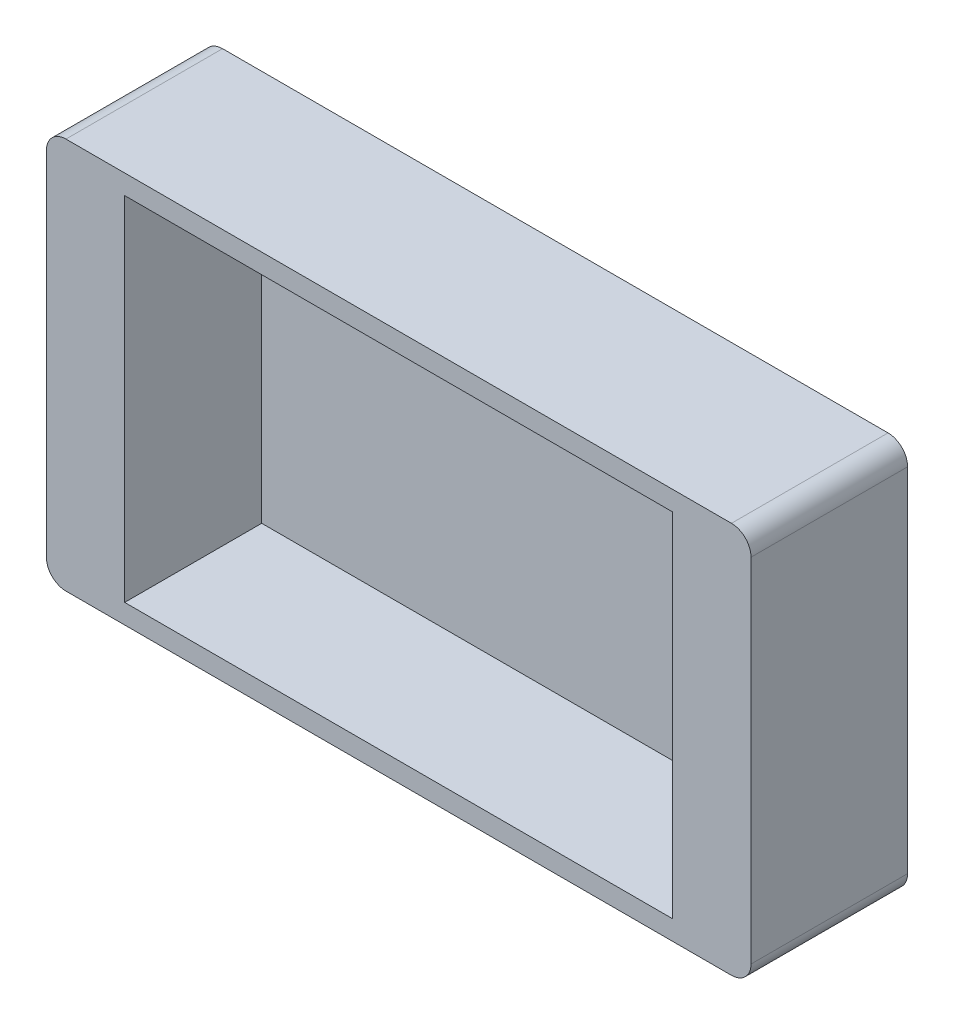
ISO-10303-21;
HEADER;
FILE_DESCRIPTION(('STEP AP214'),'2;1');
FILE_NAME('part.step','',(''),(''),'','','');
FILE_SCHEMA(('AUTOMOTIVE_DESIGN { 1 0 10303 214 1 1 1 1 }'));
ENDSEC;
DATA;
#1=APPLICATION_CONTEXT('core data for automotive mechanical design processes');
#2=APPLICATION_PROTOCOL_DEFINITION('international standard','automotive_design',2000,#1);
#3=PRODUCT_CONTEXT('',#1,'mechanical');
#4=PRODUCT('Part','Part','',(#3));
#5=PRODUCT_RELATED_PRODUCT_CATEGORY('part','',(#4));
#6=PRODUCT_DEFINITION_FORMATION('','',#4);
#7=PRODUCT_DEFINITION_CONTEXT('part definition',#1,'design');
#8=PRODUCT_DEFINITION('design','',#6,#7);
#9=PRODUCT_DEFINITION_SHAPE('','',#8);
#10=(LENGTH_UNIT() NAMED_UNIT(*) SI_UNIT(.MILLI.,.METRE.));
#11=(NAMED_UNIT(*) PLANE_ANGLE_UNIT() SI_UNIT($,.RADIAN.));
#12=(NAMED_UNIT(*) SI_UNIT($,.STERADIAN.) SOLID_ANGLE_UNIT());
#13=UNCERTAINTY_MEASURE_WITH_UNIT(LENGTH_MEASURE(1.E-05),#10,'distance_accuracy_value','');
#14=(GEOMETRIC_REPRESENTATION_CONTEXT(3) GLOBAL_UNCERTAINTY_ASSIGNED_CONTEXT((#13)) GLOBAL_UNIT_ASSIGNED_CONTEXT((#10,
#11,#12)) REPRESENTATION_CONTEXT('',''));
#15=CARTESIAN_POINT('',(0.,0.,0.));
#16=DIRECTION('',(0.,0.,1.));
#17=DIRECTION('',(1.,0.,0.));
#18=AXIS2_PLACEMENT_3D('',#15,#16,#17);
#19=CARTESIAN_POINT('',(43.18,22.86,20.32));
#20=DIRECTION('',(0.,0.,-1.));
#21=DIRECTION('',(-1.,0.,0.));
#22=AXIS2_PLACEMENT_3D('',#19,#20,#21);
#23=PLANE('',#22);
#24=DIRECTION('',(-1.,0.,0.));
#25=VECTOR('',#24,1.);
#26=CARTESIAN_POINT('',(43.18,22.86,20.32));
#27=LINE('',#26,#25);
#28=CARTESIAN_POINT('',(35.56,22.86,20.32));
#29=VERTEX_POINT('',#28);
#30=CARTESIAN_POINT('',(-35.56,22.86,20.32));
#31=VERTEX_POINT('',#30);
#32=EDGE_CURVE('E134',#29,#31,#27,.T.);
#33=ORIENTED_EDGE('',*,*,#32,.F.);
#34=DIRECTION('',(0.,-1.,0.));
#35=VECTOR('',#34,1.);
#36=CARTESIAN_POINT('',(35.56,22.86,20.32));
#37=LINE('',#36,#35);
#38=CARTESIAN_POINT('',(35.56,-22.86,20.32));
#39=VERTEX_POINT('',#38);
#40=EDGE_CURVE('E121',#29,#39,#37,.T.);
#41=ORIENTED_EDGE('',*,*,#40,.T.);
#42=DIRECTION('',(1.,0.,0.));
#43=VECTOR('',#42,1.);
#44=CARTESIAN_POINT('',(43.18,-22.86,20.32));
#45=LINE('',#44,#43);
#46=CARTESIAN_POINT('',(-35.56,-22.86,20.32));
#47=VERTEX_POINT('',#46);
#48=EDGE_CURVE('E142',#47,#39,#45,.T.);
#49=ORIENTED_EDGE('',*,*,#48,.F.);
#50=DIRECTION('',(0.,-1.,0.));
#51=VECTOR('',#50,1.);
#52=CARTESIAN_POINT('',(-35.56,22.86,20.32));
#53=LINE('',#52,#51);
#54=EDGE_CURVE('E141',#31,#47,#53,.T.);
#55=ORIENTED_EDGE('',*,*,#54,.F.);
#56=EDGE_LOOP('',(#33,#41,#49,#55));
#57=FACE_BOUND('',#56,.T.);
#58=CARTESIAN_POINT('',(43.18,22.86,20.32));
#59=DIRECTION('',(0.,0.,1.));
#60=DIRECTION('',(-1.,0.,0.));
#61=AXIS2_PLACEMENT_3D('',#58,#59,#60);
#62=CIRCLE('',#61,2.54);
#63=CARTESIAN_POINT('',(45.72,22.86,20.32));
#64=VERTEX_POINT('',#63);
#65=CARTESIAN_POINT('',(43.18,25.4,20.32));
#66=VERTEX_POINT('',#65);
#67=EDGE_CURVE('E151',#64,#66,#62,.T.);
#68=ORIENTED_EDGE('',*,*,#67,.T.);
#69=DIRECTION('',(-1.,0.,0.));
#70=VECTOR('',#69,1.);
#71=CARTESIAN_POINT('',(-43.18,25.4,20.32));
#72=LINE('',#71,#70);
#73=CARTESIAN_POINT('',(-43.18,25.4,20.32));
#74=VERTEX_POINT('',#73);
#75=EDGE_CURVE('E154',#66,#74,#72,.T.);
#76=ORIENTED_EDGE('',*,*,#75,.T.);
#77=CARTESIAN_POINT('',(-43.18,22.86,20.32));
#78=DIRECTION('',(0.,0.,1.));
#79=DIRECTION('',(1.,0.,0.));
#80=AXIS2_PLACEMENT_3D('',#77,#78,#79);
#81=CIRCLE('',#80,2.54);
#82=CARTESIAN_POINT('',(-45.72,22.86,20.32));
#83=VERTEX_POINT('',#82);
#84=EDGE_CURVE('E157',#74,#83,#81,.T.);
#85=ORIENTED_EDGE('',*,*,#84,.T.);
#86=DIRECTION('',(0.,-1.,0.));
#87=VECTOR('',#86,1.);
#88=CARTESIAN_POINT('',(-45.72,22.86,20.32));
#89=LINE('',#88,#87);
#90=CARTESIAN_POINT('',(-45.72,-22.86,20.32));
#91=VERTEX_POINT('',#90);
#92=EDGE_CURVE('E159',#83,#91,#89,.T.);
#93=ORIENTED_EDGE('',*,*,#92,.T.);
#94=CARTESIAN_POINT('',(-43.18,-22.86,20.32));
#95=DIRECTION('',(0.,0.,1.));
#96=DIRECTION('',(1.,0.,0.));
#97=AXIS2_PLACEMENT_3D('',#94,#95,#96);
#98=CIRCLE('',#97,2.54);
#99=CARTESIAN_POINT('',(-43.18,-25.4,20.32));
#100=VERTEX_POINT('',#99);
#101=EDGE_CURVE('E161',#91,#100,#98,.T.);
#102=ORIENTED_EDGE('',*,*,#101,.T.);
#103=DIRECTION('',(1.,0.,0.));
#104=VECTOR('',#103,1.);
#105=CARTESIAN_POINT('',(-43.18,-25.4,20.32));
#106=LINE('',#105,#104);
#107=CARTESIAN_POINT('',(43.18,-25.4,20.32));
#108=VERTEX_POINT('',#107);
#109=EDGE_CURVE('E163',#100,#108,#106,.T.);
#110=ORIENTED_EDGE('',*,*,#109,.T.);
#111=CARTESIAN_POINT('',(43.18,-22.86,20.32));
#112=DIRECTION('',(0.,0.,1.));
#113=DIRECTION('',(1.,0.,0.));
#114=AXIS2_PLACEMENT_3D('',#111,#112,#113);
#115=CIRCLE('',#114,2.54);
#116=CARTESIAN_POINT('',(45.72,-22.86,20.32));
#117=VERTEX_POINT('',#116);
#118=EDGE_CURVE('E165',#108,#117,#115,.T.);
#119=ORIENTED_EDGE('',*,*,#118,.T.);
#120=DIRECTION('',(0.,1.,0.));
#121=VECTOR('',#120,1.);
#122=CARTESIAN_POINT('',(45.72,22.86,20.32));
#123=LINE('',#122,#121);
#124=EDGE_CURVE('E167',#117,#64,#123,.T.);
#125=ORIENTED_EDGE('',*,*,#124,.T.);
#126=EDGE_LOOP('',(#68,#76,#85,#93,#102,#110,#119,#125));
#127=FACE_BOUND('',#126,.T.);
#128=ADVANCED_FACE('F33',(#57,#127),#23,.F.);
#129=CARTESIAN_POINT('',(43.18,22.86,20.32));
#130=DIRECTION('',(0.,0.,-1.));
#131=DIRECTION('',(-1.,0.,0.));
#132=AXIS2_PLACEMENT_3D('',#129,#130,#131);
#133=CYLINDRICAL_SURFACE('',#132,2.54);
#134=CARTESIAN_POINT('',(43.18,22.86,0.));
#135=DIRECTION('',(0.,0.,1.));
#136=DIRECTION('',(-1.,0.,0.));
#137=AXIS2_PLACEMENT_3D('',#134,#135,#136);
#138=CIRCLE('',#137,2.54);
#139=CARTESIAN_POINT('',(45.72,22.86,0.));
#140=VERTEX_POINT('',#139);
#141=CARTESIAN_POINT('',(43.18,25.4,0.));
#142=VERTEX_POINT('',#141);
#143=EDGE_CURVE('E145',#140,#142,#138,.T.);
#144=ORIENTED_EDGE('',*,*,#143,.T.);
#145=DIRECTION('',(0.,0.,-1.));
#146=VECTOR('',#145,1.);
#147=CARTESIAN_POINT('',(43.18,25.4,20.32));
#148=LINE('',#147,#146);
#149=EDGE_CURVE('E11',#66,#142,#148,.T.);
#150=ORIENTED_EDGE('',*,*,#149,.F.);
#151=ORIENTED_EDGE('',*,*,#67,.F.);
#152=DIRECTION('',(0.,0.,-1.));
#153=VECTOR('',#152,1.);
#154=CARTESIAN_POINT('',(45.72,22.86,20.32));
#155=LINE('',#154,#153);
#156=EDGE_CURVE('E169',#64,#140,#155,.T.);
#157=ORIENTED_EDGE('',*,*,#156,.T.);
#158=EDGE_LOOP('',(#144,#150,#151,#157));
#159=FACE_BOUND('',#158,.T.);
#160=ADVANCED_FACE('F35',(#159),#133,.T.);
#161=CARTESIAN_POINT('',(-43.18,25.4,20.32));
#162=DIRECTION('',(0.,-1.,0.));
#163=DIRECTION('',(0.,0.,-1.));
#164=AXIS2_PLACEMENT_3D('',#161,#162,#163);
#165=PLANE('',#164);
#166=DIRECTION('',(-1.,0.,0.));
#167=VECTOR('',#166,1.);
#168=CARTESIAN_POINT('',(-43.18,25.4,0.));
#169=LINE('',#168,#167);
#170=CARTESIAN_POINT('',(-43.18,25.4,0.));
#171=VERTEX_POINT('',#170);
#172=EDGE_CURVE('E172',#142,#171,#169,.T.);
#173=ORIENTED_EDGE('',*,*,#172,.T.);
#174=DIRECTION('',(0.,0.,-1.));
#175=VECTOR('',#174,1.);
#176=CARTESIAN_POINT('',(-43.18,25.4,20.32));
#177=LINE('',#176,#175);
#178=EDGE_CURVE('E41',#74,#171,#177,.T.);
#179=ORIENTED_EDGE('',*,*,#178,.F.);
#180=ORIENTED_EDGE('',*,*,#75,.F.);
#181=ORIENTED_EDGE('',*,*,#149,.T.);
#182=EDGE_LOOP('',(#173,#179,#180,#181));
#183=FACE_BOUND('',#182,.T.);
#184=ADVANCED_FACE('F227',(#183),#165,.F.);
#185=CARTESIAN_POINT('',(-43.18,22.86,20.32));
#186=DIRECTION('',(0.,0.,-1.));
#187=DIRECTION('',(-1.,0.,0.));
#188=AXIS2_PLACEMENT_3D('',#185,#186,#187);
#189=CYLINDRICAL_SURFACE('',#188,2.54);
#190=CARTESIAN_POINT('',(-43.18,22.86,0.));
#191=DIRECTION('',(0.,0.,1.));
#192=DIRECTION('',(1.,0.,0.));
#193=AXIS2_PLACEMENT_3D('',#190,#191,#192);
#194=CIRCLE('',#193,2.54);
#195=CARTESIAN_POINT('',(-45.72,22.86,0.));
#196=VERTEX_POINT('',#195);
#197=EDGE_CURVE('E174',#171,#196,#194,.T.);
#198=ORIENTED_EDGE('',*,*,#197,.T.);
#199=DIRECTION('',(0.,0.,-1.));
#200=VECTOR('',#199,1.);
#201=CARTESIAN_POINT('',(-45.72,22.86,20.32));
#202=LINE('',#201,#200);
#203=EDGE_CURVE('E199',#83,#196,#202,.T.);
#204=ORIENTED_EDGE('',*,*,#203,.F.);
#205=ORIENTED_EDGE('',*,*,#84,.F.);
#206=ORIENTED_EDGE('',*,*,#178,.T.);
#207=EDGE_LOOP('',(#198,#204,#205,#206));
#208=FACE_BOUND('',#207,.T.);
#209=ADVANCED_FACE('F206',(#208),#189,.T.);
#210=CARTESIAN_POINT('',(-45.72,22.86,20.32));
#211=DIRECTION('',(1.,0.,0.));
#212=DIRECTION('',(0.,0.,-1.));
#213=AXIS2_PLACEMENT_3D('',#210,#211,#212);
#214=PLANE('',#213);
#215=DIRECTION('',(0.,-1.,0.));
#216=VECTOR('',#215,1.);
#217=CARTESIAN_POINT('',(-45.72,22.86,0.));
#218=LINE('',#217,#216);
#219=CARTESIAN_POINT('',(-45.72,-22.86,0.));
#220=VERTEX_POINT('',#219);
#221=EDGE_CURVE('E176',#196,#220,#218,.T.);
#222=ORIENTED_EDGE('',*,*,#221,.T.);
#223=DIRECTION('',(0.,0.,-1.));
#224=VECTOR('',#223,1.);
#225=CARTESIAN_POINT('',(-45.72,-22.86,20.32));
#226=LINE('',#225,#224);
#227=EDGE_CURVE('E196',#91,#220,#226,.T.);
#228=ORIENTED_EDGE('',*,*,#227,.F.);
#229=ORIENTED_EDGE('',*,*,#92,.F.);
#230=ORIENTED_EDGE('',*,*,#203,.T.);
#231=EDGE_LOOP('',(#222,#228,#229,#230));
#232=FACE_BOUND('',#231,.T.);
#233=ADVANCED_FACE('F217',(#232),#214,.F.);
#234=CARTESIAN_POINT('',(-43.18,-22.86,20.32));
#235=DIRECTION('',(0.,0.,-1.));
#236=DIRECTION('',(-1.,0.,0.));
#237=AXIS2_PLACEMENT_3D('',#234,#235,#236);
#238=CYLINDRICAL_SURFACE('',#237,2.54);
#239=CARTESIAN_POINT('',(-43.18,-22.86,0.));
#240=DIRECTION('',(0.,0.,1.));
#241=DIRECTION('',(1.,0.,0.));
#242=AXIS2_PLACEMENT_3D('',#239,#240,#241);
#243=CIRCLE('',#242,2.54);
#244=CARTESIAN_POINT('',(-43.18,-25.4,0.));
#245=VERTEX_POINT('',#244);
#246=EDGE_CURVE('E178',#220,#245,#243,.T.);
#247=ORIENTED_EDGE('',*,*,#246,.T.);
#248=DIRECTION('',(0.,0.,-1.));
#249=VECTOR('',#248,1.);
#250=CARTESIAN_POINT('',(-43.18,-25.4,20.32));
#251=LINE('',#250,#249);
#252=EDGE_CURVE('E193',#100,#245,#251,.T.);
#253=ORIENTED_EDGE('',*,*,#252,.F.);
#254=ORIENTED_EDGE('',*,*,#101,.F.);
#255=ORIENTED_EDGE('',*,*,#227,.T.);
#256=EDGE_LOOP('',(#247,#253,#254,#255));
#257=FACE_BOUND('',#256,.T.);
#258=ADVANCED_FACE('F221',(#257),#238,.T.);
#259=CARTESIAN_POINT('',(-43.18,-25.4,20.32));
#260=DIRECTION('',(0.,1.,0.));
#261=DIRECTION('',(0.,0.,1.));
#262=AXIS2_PLACEMENT_3D('',#259,#260,#261);
#263=PLANE('',#262);
#264=DIRECTION('',(1.,0.,0.));
#265=VECTOR('',#264,1.);
#266=CARTESIAN_POINT('',(-43.18,-25.4,0.));
#267=LINE('',#266,#265);
#268=CARTESIAN_POINT('',(43.18,-25.4,0.));
#269=VERTEX_POINT('',#268);
#270=EDGE_CURVE('E180',#245,#269,#267,.T.);
#271=ORIENTED_EDGE('',*,*,#270,.T.);
#272=DIRECTION('',(0.,0.,-1.));
#273=VECTOR('',#272,1.);
#274=CARTESIAN_POINT('',(43.18,-25.4,20.32));
#275=LINE('',#274,#273);
#276=EDGE_CURVE('E190',#108,#269,#275,.T.);
#277=ORIENTED_EDGE('',*,*,#276,.F.);
#278=ORIENTED_EDGE('',*,*,#109,.F.);
#279=ORIENTED_EDGE('',*,*,#252,.T.);
#280=EDGE_LOOP('',(#271,#277,#278,#279));
#281=FACE_BOUND('',#280,.T.);
#282=ADVANCED_FACE('F240',(#281),#263,.F.);
#283=CARTESIAN_POINT('',(43.18,-22.86,20.32));
#284=DIRECTION('',(0.,0.,-1.));
#285=DIRECTION('',(-1.,0.,0.));
#286=AXIS2_PLACEMENT_3D('',#283,#284,#285);
#287=CYLINDRICAL_SURFACE('',#286,2.54);
#288=CARTESIAN_POINT('',(43.18,-22.86,0.));
#289=DIRECTION('',(0.,0.,1.));
#290=DIRECTION('',(1.,0.,0.));
#291=AXIS2_PLACEMENT_3D('',#288,#289,#290);
#292=CIRCLE('',#291,2.54);
#293=CARTESIAN_POINT('',(45.72,-22.86,0.));
#294=VERTEX_POINT('',#293);
#295=EDGE_CURVE('E182',#269,#294,#292,.T.);
#296=ORIENTED_EDGE('',*,*,#295,.T.);
#297=DIRECTION('',(0.,0.,-1.));
#298=VECTOR('',#297,1.);
#299=CARTESIAN_POINT('',(45.72,-22.86,20.32));
#300=LINE('',#299,#298);
#301=EDGE_CURVE('E187',#117,#294,#300,.T.);
#302=ORIENTED_EDGE('',*,*,#301,.F.);
#303=ORIENTED_EDGE('',*,*,#118,.F.);
#304=ORIENTED_EDGE('',*,*,#276,.T.);
#305=EDGE_LOOP('',(#296,#302,#303,#304));
#306=FACE_BOUND('',#305,.T.);
#307=ADVANCED_FACE('F238',(#306),#287,.T.);
#308=CARTESIAN_POINT('',(45.72,22.86,20.32));
#309=DIRECTION('',(-1.,0.,0.));
#310=DIRECTION('',(0.,-1.,0.));
#311=AXIS2_PLACEMENT_3D('',#308,#309,#310);
#312=PLANE('',#311);
#313=DIRECTION('',(0.,1.,0.));
#314=VECTOR('',#313,1.);
#315=CARTESIAN_POINT('',(45.72,22.86,0.));
#316=LINE('',#315,#314);
#317=EDGE_CURVE('E155',#294,#140,#316,.T.);
#318=ORIENTED_EDGE('',*,*,#317,.T.);
#319=ORIENTED_EDGE('',*,*,#156,.F.);
#320=ORIENTED_EDGE('',*,*,#124,.F.);
#321=ORIENTED_EDGE('',*,*,#301,.T.);
#322=EDGE_LOOP('',(#318,#319,#320,#321));
#323=FACE_BOUND('',#322,.T.);
#324=ADVANCED_FACE('F233',(#323),#312,.F.);
#325=CARTESIAN_POINT('',(43.18,22.86,0.));
#326=DIRECTION('',(0.,0.,-1.));
#327=DIRECTION('',(-1.,0.,0.));
#328=AXIS2_PLACEMENT_3D('',#325,#326,#327);
#329=PLANE('',#328);
#330=ORIENTED_EDGE('',*,*,#143,.F.);
#331=ORIENTED_EDGE('',*,*,#317,.F.);
#332=ORIENTED_EDGE('',*,*,#295,.F.);
#333=ORIENTED_EDGE('',*,*,#270,.F.);
#334=ORIENTED_EDGE('',*,*,#246,.F.);
#335=ORIENTED_EDGE('',*,*,#221,.F.);
#336=ORIENTED_EDGE('',*,*,#197,.F.);
#337=ORIENTED_EDGE('',*,*,#172,.F.);
#338=EDGE_LOOP('',(#330,#331,#332,#333,#334,#335,#336,#337));
#339=FACE_BOUND('',#338,.T.);
#340=ADVANCED_FACE('F212',(#339),#329,.T.);
#341=CARTESIAN_POINT('',(-43.18,22.86,20.32));
#342=DIRECTION('',(0.,-1.,0.));
#343=DIRECTION('',(0.,0.,-1.));
#344=AXIS2_PLACEMENT_3D('',#341,#342,#343);
#345=PLANE('',#344);
#346=DIRECTION('',(0.,0.,1.));
#347=VECTOR('',#346,1.);
#348=CARTESIAN_POINT('',(35.56,22.86,20.32));
#349=LINE('',#348,#347);
#350=CARTESIAN_POINT('',(35.56,22.86,2.54));
#351=VERTEX_POINT('',#350);
#352=EDGE_CURVE('E48',#351,#29,#349,.T.);
#353=ORIENTED_EDGE('',*,*,#352,.T.);
#354=ORIENTED_EDGE('',*,*,#32,.T.);
#355=DIRECTION('',(0.,0.,1.));
#356=VECTOR('',#355,1.);
#357=CARTESIAN_POINT('',(-35.56,22.86,20.32));
#358=LINE('',#357,#356);
#359=CARTESIAN_POINT('',(-35.56,22.86,2.54));
#360=VERTEX_POINT('',#359);
#361=EDGE_CURVE('E370',#360,#31,#358,.T.);
#362=ORIENTED_EDGE('',*,*,#361,.F.);
#363=DIRECTION('',(-1.,0.,0.));
#364=VECTOR('',#363,1.);
#365=CARTESIAN_POINT('',(43.18,22.86,2.54));
#366=LINE('',#365,#364);
#367=EDGE_CURVE('E136',#351,#360,#366,.T.);
#368=ORIENTED_EDGE('',*,*,#367,.F.);
#369=EDGE_LOOP('',(#353,#354,#362,#368));
#370=FACE_BOUND('',#369,.T.);
#371=ADVANCED_FACE('F132',(#370),#345,.T.);
#372=CARTESIAN_POINT('',(-43.18,-22.86,20.32));
#373=DIRECTION('',(0.,1.,0.));
#374=DIRECTION('',(0.,0.,1.));
#375=AXIS2_PLACEMENT_3D('',#372,#373,#374);
#376=PLANE('',#375);
#377=DIRECTION('',(0.,0.,-1.));
#378=VECTOR('',#377,1.);
#379=CARTESIAN_POINT('',(35.56,-22.86,20.32));
#380=LINE('',#379,#378);
#381=CARTESIAN_POINT('',(35.56,-22.86,2.54));
#382=VERTEX_POINT('',#381);
#383=EDGE_CURVE('E124',#39,#382,#380,.T.);
#384=ORIENTED_EDGE('',*,*,#383,.T.);
#385=DIRECTION('',(1.,0.,0.));
#386=VECTOR('',#385,1.);
#387=CARTESIAN_POINT('',(43.18,-22.86,2.54));
#388=LINE('',#387,#386);
#389=CARTESIAN_POINT('',(-35.56,-22.86,2.54));
#390=VERTEX_POINT('',#389);
#391=EDGE_CURVE('E143',#390,#382,#388,.T.);
#392=ORIENTED_EDGE('',*,*,#391,.F.);
#393=DIRECTION('',(0.,0.,-1.));
#394=VECTOR('',#393,1.);
#395=CARTESIAN_POINT('',(-35.56,-22.86,20.32));
#396=LINE('',#395,#394);
#397=EDGE_CURVE('E56',#47,#390,#396,.T.);
#398=ORIENTED_EDGE('',*,*,#397,.F.);
#399=ORIENTED_EDGE('',*,*,#48,.T.);
#400=EDGE_LOOP('',(#384,#392,#398,#399));
#401=FACE_BOUND('',#400,.T.);
#402=ADVANCED_FACE('F276',(#401),#376,.T.);
#403=CARTESIAN_POINT('',(43.18,22.86,2.54));
#404=DIRECTION('',(0.,0.,-1.));
#405=DIRECTION('',(-1.,0.,0.));
#406=AXIS2_PLACEMENT_3D('',#403,#404,#405);
#407=PLANE('',#406);
#408=ORIENTED_EDGE('',*,*,#391,.T.);
#409=DIRECTION('',(0.,1.,0.));
#410=VECTOR('',#409,1.);
#411=CARTESIAN_POINT('',(35.56,22.86,2.54));
#412=LINE('',#411,#410);
#413=EDGE_CURVE('E137',#382,#351,#412,.T.);
#414=ORIENTED_EDGE('',*,*,#413,.T.);
#415=ORIENTED_EDGE('',*,*,#367,.T.);
#416=DIRECTION('',(0.,1.,0.));
#417=VECTOR('',#416,1.);
#418=CARTESIAN_POINT('',(-35.56,22.86,2.54));
#419=LINE('',#418,#417);
#420=EDGE_CURVE('E373',#390,#360,#419,.T.);
#421=ORIENTED_EDGE('',*,*,#420,.F.);
#422=EDGE_LOOP('',(#408,#414,#415,#421));
#423=FACE_BOUND('',#422,.T.);
#424=ADVANCED_FACE('F256',(#423),#407,.F.);
#425=CARTESIAN_POINT('',(-35.56,0.,0.));
#426=DIRECTION('',(1.,0.,0.));
#427=DIRECTION('',(0.,1.,0.));
#428=AXIS2_PLACEMENT_3D('',#425,#426,#427);
#429=PLANE('',#428);
#430=ORIENTED_EDGE('',*,*,#54,.T.);
#431=ORIENTED_EDGE('',*,*,#397,.T.);
#432=ORIENTED_EDGE('',*,*,#420,.T.);
#433=ORIENTED_EDGE('',*,*,#361,.T.);
#434=EDGE_LOOP('',(#430,#431,#432,#433));
#435=FACE_BOUND('',#434,.T.);
#436=ADVANCED_FACE('F289',(#435),#429,.T.);
#437=CARTESIAN_POINT('',(35.56,0.,0.));
#438=DIRECTION('',(-1.,0.,0.));
#439=DIRECTION('',(0.,1.,0.));
#440=AXIS2_PLACEMENT_3D('',#437,#438,#439);
#441=PLANE('',#440);
#442=ORIENTED_EDGE('',*,*,#40,.F.);
#443=ORIENTED_EDGE('',*,*,#352,.F.);
#444=ORIENTED_EDGE('',*,*,#413,.F.);
#445=ORIENTED_EDGE('',*,*,#383,.F.);
#446=EDGE_LOOP('',(#442,#443,#444,#445));
#447=FACE_BOUND('',#446,.T.);
#448=ADVANCED_FACE('F122',(#447),#441,.T.);
#449=CLOSED_SHELL('',(#128,#160,#184,#209,#233,#258,#282,#307,#324,#340,#371,#402,#424,#436,#448));
#450=MANIFOLD_SOLID_BREP('B2',#449);
#451=ADVANCED_BREP_SHAPE_REPRESENTATION('',(#18,#450),#14);
#452=SHAPE_DEFINITION_REPRESENTATION(#9,#451);
ENDSEC;
END-ISO-10303-21;
